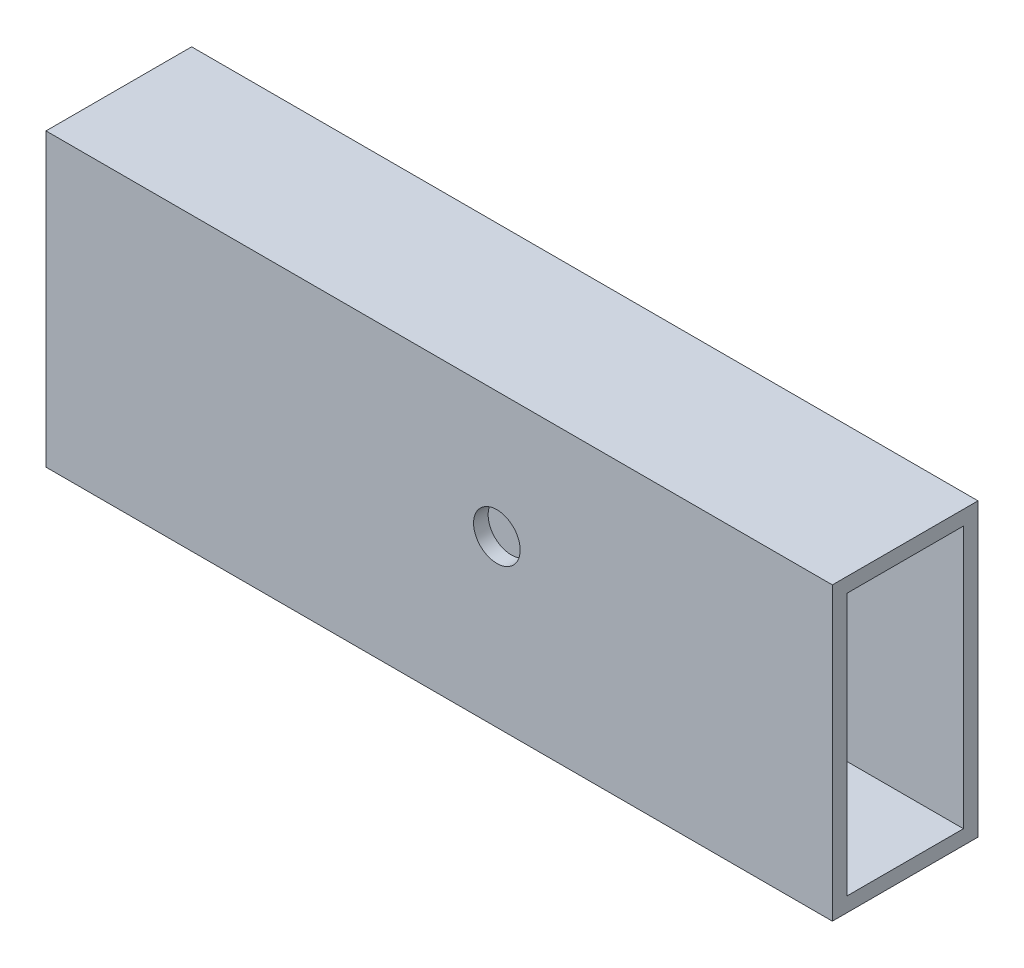
ISO-10303-21;
HEADER;
FILE_DESCRIPTION(('STEP AP214'),'2;1');
FILE_NAME('part.step','',(''),(''),'','','');
FILE_SCHEMA(('AUTOMOTIVE_DESIGN { 1 0 10303 214 1 1 1 1 }'));
ENDSEC;
DATA;
#1=APPLICATION_CONTEXT('core data for automotive mechanical design processes');
#2=APPLICATION_PROTOCOL_DEFINITION('international standard','automotive_design',2000,#1);
#3=PRODUCT_CONTEXT('',#1,'mechanical');
#4=PRODUCT('Part','Part','',(#3));
#5=PRODUCT_RELATED_PRODUCT_CATEGORY('part','',(#4));
#6=PRODUCT_DEFINITION_FORMATION('','',#4);
#7=PRODUCT_DEFINITION_CONTEXT('part definition',#1,'design');
#8=PRODUCT_DEFINITION('design','',#6,#7);
#9=PRODUCT_DEFINITION_SHAPE('','',#8);
#10=(LENGTH_UNIT() NAMED_UNIT(*) SI_UNIT(.MILLI.,.METRE.));
#11=(NAMED_UNIT(*) PLANE_ANGLE_UNIT() SI_UNIT($,.RADIAN.));
#12=(NAMED_UNIT(*) SI_UNIT($,.STERADIAN.) SOLID_ANGLE_UNIT());
#13=UNCERTAINTY_MEASURE_WITH_UNIT(LENGTH_MEASURE(1.E-05),#10,'distance_accuracy_value','');
#14=(GEOMETRIC_REPRESENTATION_CONTEXT(3) GLOBAL_UNCERTAINTY_ASSIGNED_CONTEXT((#13)) GLOBAL_UNIT_ASSIGNED_CONTEXT((#10,
#11,#12)) REPRESENTATION_CONTEXT('',''));
#15=CARTESIAN_POINT('',(0.,0.,0.));
#16=DIRECTION('',(0.,0.,1.));
#17=DIRECTION('',(1.,0.,0.));
#18=AXIS2_PLACEMENT_3D('',#15,#16,#17);
#19=CARTESIAN_POINT('',(-135.,-25.,12.5));
#20=DIRECTION('',(0.,0.,1.));
#21=DIRECTION('',(1.,0.,0.));
#22=AXIS2_PLACEMENT_3D('',#19,#20,#21);
#23=PLANE('',#22);
#24=CARTESIAN_POINT('',(-57.6002904536009,3.38908975462313,12.5));
#25=DIRECTION('',(0.,0.,1.));
#26=DIRECTION('',(1.,0.,0.));
#27=AXIS2_PLACEMENT_3D('',#24,#25,#26);
#28=CIRCLE('',#27,4.00000000000001);
#29=CARTESIAN_POINT('',(-53.6002904536009,3.38908975462313,12.5));
#30=VERTEX_POINT('',#29);
#31=EDGE_CURVE('E126',#30,#30,#28,.T.);
#32=ORIENTED_EDGE('',*,*,#31,.F.);
#33=EDGE_LOOP('',(#32));
#34=FACE_BOUND('',#33,.T.);
#35=DIRECTION('',(0.,-1.,0.));
#36=VECTOR('',#35,1.);
#37=CARTESIAN_POINT('',(0.,-25.,12.5));
#38=LINE('',#37,#36);
#39=CARTESIAN_POINT('',(0.,25.,12.5));
#40=VERTEX_POINT('',#39);
#41=CARTESIAN_POINT('',(0.,-25.,12.5));
#42=VERTEX_POINT('',#41);
#43=EDGE_CURVE('E137',#40,#42,#38,.T.);
#44=ORIENTED_EDGE('',*,*,#43,.F.);
#45=DIRECTION('',(1.,0.,0.));
#46=VECTOR('',#45,1.);
#47=CARTESIAN_POINT('',(-135.,25.,12.5));
#48=LINE('',#47,#46);
#49=CARTESIAN_POINT('',(-135.,25.,12.5));
#50=VERTEX_POINT('',#49);
#51=EDGE_CURVE('E11',#50,#40,#48,.T.);
#52=ORIENTED_EDGE('',*,*,#51,.F.);
#53=DIRECTION('',(0.,-1.,0.));
#54=VECTOR('',#53,1.);
#55=CARTESIAN_POINT('',(-135.,-25.,12.5));
#56=LINE('',#55,#54);
#57=CARTESIAN_POINT('',(-135.,-25.,12.5));
#58=VERTEX_POINT('',#57);
#59=EDGE_CURVE('E141',#50,#58,#56,.T.);
#60=ORIENTED_EDGE('',*,*,#59,.T.);
#61=DIRECTION('',(1.,0.,0.));
#62=VECTOR('',#61,1.);
#63=CARTESIAN_POINT('',(-135.,-25.,12.5));
#64=LINE('',#63,#62);
#65=EDGE_CURVE('E154',#58,#42,#64,.T.);
#66=ORIENTED_EDGE('',*,*,#65,.T.);
#67=EDGE_LOOP('',(#44,#52,#60,#66));
#68=FACE_BOUND('',#67,.T.);
#69=ADVANCED_FACE('F37',(#34,#68),#23,.T.);
#70=CARTESIAN_POINT('',(-135.,25.,-12.5));
#71=DIRECTION('',(0.,1.,0.));
#72=DIRECTION('',(0.,0.,1.));
#73=AXIS2_PLACEMENT_3D('',#70,#71,#72);
#74=PLANE('',#73);
#75=DIRECTION('',(0.,0.,1.));
#76=VECTOR('',#75,1.);
#77=CARTESIAN_POINT('',(0.,25.,-12.5));
#78=LINE('',#77,#76);
#79=CARTESIAN_POINT('',(0.,25.,-12.5));
#80=VERTEX_POINT('',#79);
#81=EDGE_CURVE('E145',#80,#40,#78,.T.);
#82=ORIENTED_EDGE('',*,*,#81,.F.);
#83=DIRECTION('',(1.,0.,0.));
#84=VECTOR('',#83,1.);
#85=CARTESIAN_POINT('',(-135.,25.,-12.5));
#86=LINE('',#85,#84);
#87=CARTESIAN_POINT('',(-135.,25.,-12.5));
#88=VERTEX_POINT('',#87);
#89=EDGE_CURVE('E45',#88,#80,#86,.T.);
#90=ORIENTED_EDGE('',*,*,#89,.F.);
#91=DIRECTION('',(0.,0.,1.));
#92=VECTOR('',#91,1.);
#93=CARTESIAN_POINT('',(-135.,25.,-12.5));
#94=LINE('',#93,#92);
#95=EDGE_CURVE('E151',#88,#50,#94,.T.);
#96=ORIENTED_EDGE('',*,*,#95,.T.);
#97=ORIENTED_EDGE('',*,*,#51,.T.);
#98=EDGE_LOOP('',(#82,#90,#96,#97));
#99=FACE_BOUND('',#98,.T.);
#100=ADVANCED_FACE('F179',(#99),#74,.T.);
#101=CARTESIAN_POINT('',(-135.,-25.,-12.5));
#102=DIRECTION('',(0.,0.,-1.));
#103=DIRECTION('',(-1.,0.,0.));
#104=AXIS2_PLACEMENT_3D('',#101,#102,#103);
#105=PLANE('',#104);
#106=DIRECTION('',(0.,1.,0.));
#107=VECTOR('',#106,1.);
#108=CARTESIAN_POINT('',(0.,-25.,-12.5));
#109=LINE('',#108,#107);
#110=CARTESIAN_POINT('',(0.,-25.,-12.5));
#111=VERTEX_POINT('',#110);
#112=EDGE_CURVE('E160',#111,#80,#109,.T.);
#113=ORIENTED_EDGE('',*,*,#112,.F.);
#114=DIRECTION('',(1.,0.,0.));
#115=VECTOR('',#114,1.);
#116=CARTESIAN_POINT('',(-135.,-25.,-12.5));
#117=LINE('',#116,#115);
#118=CARTESIAN_POINT('',(-135.,-25.,-12.5));
#119=VERTEX_POINT('',#118);
#120=EDGE_CURVE('E166',#119,#111,#117,.T.);
#121=ORIENTED_EDGE('',*,*,#120,.F.);
#122=DIRECTION('',(0.,1.,0.));
#123=VECTOR('',#122,1.);
#124=CARTESIAN_POINT('',(-135.,-25.,-12.5));
#125=LINE('',#124,#123);
#126=EDGE_CURVE('E148',#119,#88,#125,.T.);
#127=ORIENTED_EDGE('',*,*,#126,.T.);
#128=ORIENTED_EDGE('',*,*,#89,.T.);
#129=EDGE_LOOP('',(#113,#121,#127,#128));
#130=FACE_BOUND('',#129,.T.);
#131=ADVANCED_FACE('F183',(#130),#105,.T.);
#132=CARTESIAN_POINT('',(-135.,-25.,-12.5));
#133=DIRECTION('',(0.,-1.,0.));
#134=DIRECTION('',(0.,0.,-1.));
#135=AXIS2_PLACEMENT_3D('',#132,#133,#134);
#136=PLANE('',#135);
#137=DIRECTION('',(0.,0.,-1.));
#138=VECTOR('',#137,1.);
#139=CARTESIAN_POINT('',(0.,-25.,-12.5));
#140=LINE('',#139,#138);
#141=EDGE_CURVE('E157',#42,#111,#140,.T.);
#142=ORIENTED_EDGE('',*,*,#141,.F.);
#143=ORIENTED_EDGE('',*,*,#65,.F.);
#144=DIRECTION('',(0.,0.,-1.));
#145=VECTOR('',#144,1.);
#146=CARTESIAN_POINT('',(-135.,-25.,-12.5));
#147=LINE('',#146,#145);
#148=EDGE_CURVE('E144',#58,#119,#147,.T.);
#149=ORIENTED_EDGE('',*,*,#148,.T.);
#150=ORIENTED_EDGE('',*,*,#120,.T.);
#151=EDGE_LOOP('',(#142,#143,#149,#150));
#152=FACE_BOUND('',#151,.T.);
#153=ADVANCED_FACE('F173',(#152),#136,.T.);
#154=CARTESIAN_POINT('',(-135.,0.,0.));
#155=DIRECTION('',(1.,0.,0.));
#156=DIRECTION('',(0.,0.,-1.));
#157=AXIS2_PLACEMENT_3D('',#154,#155,#156);
#158=PLANE('',#157);
#159=DIRECTION('',(0.,0.,1.));
#160=VECTOR('',#159,1.);
#161=CARTESIAN_POINT('',(-135.,22.5,-10.));
#162=LINE('',#161,#160);
#163=CARTESIAN_POINT('',(-135.,22.5,-10.));
#164=VERTEX_POINT('',#163);
#165=CARTESIAN_POINT('',(-135.,22.5,10.));
#166=VERTEX_POINT('',#165);
#167=EDGE_CURVE('E110',#164,#166,#162,.T.);
#168=ORIENTED_EDGE('',*,*,#167,.T.);
#169=DIRECTION('',(0.,-1.,0.));
#170=VECTOR('',#169,1.);
#171=CARTESIAN_POINT('',(-135.,-22.5,10.));
#172=LINE('',#171,#170);
#173=CARTESIAN_POINT('',(-135.,-22.5,10.));
#174=VERTEX_POINT('',#173);
#175=EDGE_CURVE('E104',#166,#174,#172,.T.);
#176=ORIENTED_EDGE('',*,*,#175,.T.);
#177=DIRECTION('',(0.,0.,-1.));
#178=VECTOR('',#177,1.);
#179=CARTESIAN_POINT('',(-135.,-22.5,-10.));
#180=LINE('',#179,#178);
#181=CARTESIAN_POINT('',(-135.,-22.5,-10.));
#182=VERTEX_POINT('',#181);
#183=EDGE_CURVE('E113',#174,#182,#180,.T.);
#184=ORIENTED_EDGE('',*,*,#183,.T.);
#185=DIRECTION('',(0.,1.,0.));
#186=VECTOR('',#185,1.);
#187=CARTESIAN_POINT('',(-135.,-22.5,-10.));
#188=LINE('',#187,#186);
#189=EDGE_CURVE('E53',#182,#164,#188,.T.);
#190=ORIENTED_EDGE('',*,*,#189,.T.);
#191=EDGE_LOOP('',(#168,#176,#184,#190));
#192=FACE_BOUND('',#191,.T.);
#193=ORIENTED_EDGE('',*,*,#59,.F.);
#194=ORIENTED_EDGE('',*,*,#95,.F.);
#195=ORIENTED_EDGE('',*,*,#126,.F.);
#196=ORIENTED_EDGE('',*,*,#148,.F.);
#197=EDGE_LOOP('',(#193,#194,#195,#196));
#198=FACE_BOUND('',#197,.T.);
#199=ADVANCED_FACE('F117',(#192,#198),#158,.F.);
#200=CARTESIAN_POINT('',(0.,0.,0.));
#201=DIRECTION('',(1.,0.,0.));
#202=DIRECTION('',(0.,0.,-1.));
#203=AXIS2_PLACEMENT_3D('',#200,#201,#202);
#204=PLANE('',#203);
#205=DIRECTION('',(0.,-1.,0.));
#206=VECTOR('',#205,1.);
#207=CARTESIAN_POINT('',(0.,-22.5,10.));
#208=LINE('',#207,#206);
#209=CARTESIAN_POINT('',(0.,22.5,10.));
#210=VERTEX_POINT('',#209);
#211=CARTESIAN_POINT('',(0.,-22.5,10.));
#212=VERTEX_POINT('',#211);
#213=EDGE_CURVE('E61',#210,#212,#208,.T.);
#214=ORIENTED_EDGE('',*,*,#213,.F.);
#215=DIRECTION('',(0.,0.,1.));
#216=VECTOR('',#215,1.);
#217=CARTESIAN_POINT('',(0.,22.5,-10.));
#218=LINE('',#217,#216);
#219=CARTESIAN_POINT('',(0.,22.5,-10.));
#220=VERTEX_POINT('',#219);
#221=EDGE_CURVE('E120',#220,#210,#218,.T.);
#222=ORIENTED_EDGE('',*,*,#221,.F.);
#223=DIRECTION('',(0.,1.,0.));
#224=VECTOR('',#223,1.);
#225=CARTESIAN_POINT('',(0.,-22.5,-10.));
#226=LINE('',#225,#224);
#227=CARTESIAN_POINT('',(0.,-22.5,-10.));
#228=VERTEX_POINT('',#227);
#229=EDGE_CURVE('E123',#228,#220,#226,.T.);
#230=ORIENTED_EDGE('',*,*,#229,.F.);
#231=DIRECTION('',(0.,0.,-1.));
#232=VECTOR('',#231,1.);
#233=CARTESIAN_POINT('',(0.,-22.5,-10.));
#234=LINE('',#233,#232);
#235=EDGE_CURVE('E131',#212,#228,#234,.T.);
#236=ORIENTED_EDGE('',*,*,#235,.F.);
#237=EDGE_LOOP('',(#214,#222,#230,#236));
#238=FACE_BOUND('',#237,.T.);
#239=ORIENTED_EDGE('',*,*,#43,.T.);
#240=ORIENTED_EDGE('',*,*,#141,.T.);
#241=ORIENTED_EDGE('',*,*,#112,.T.);
#242=ORIENTED_EDGE('',*,*,#81,.T.);
#243=EDGE_LOOP('',(#239,#240,#241,#242));
#244=FACE_BOUND('',#243,.T.);
#245=ADVANCED_FACE('F176',(#238,#244),#204,.T.);
#246=CARTESIAN_POINT('',(-135.,-22.5,10.));
#247=DIRECTION('',(0.,0.,1.));
#248=DIRECTION('',(1.,0.,0.));
#249=AXIS2_PLACEMENT_3D('',#246,#247,#248);
#250=PLANE('',#249);
#251=CARTESIAN_POINT('',(-57.6002904536009,3.38908975462313,10.));
#252=DIRECTION('',(0.,0.,1.));
#253=DIRECTION('',(1.,0.,0.));
#254=AXIS2_PLACEMENT_3D('',#251,#252,#253);
#255=CIRCLE('',#254,4.00000000000001);
#256=CARTESIAN_POINT('',(-53.6002904536009,3.38908975462313,10.));
#257=VERTEX_POINT('',#256);
#258=EDGE_CURVE('E40',#257,#257,#255,.F.);
#259=ORIENTED_EDGE('',*,*,#258,.F.);
#260=EDGE_LOOP('',(#259));
#261=FACE_BOUND('',#260,.T.);
#262=ORIENTED_EDGE('',*,*,#213,.T.);
#263=DIRECTION('',(1.,0.,0.));
#264=VECTOR('',#263,1.);
#265=CARTESIAN_POINT('',(-135.,-22.5,10.));
#266=LINE('',#265,#264);
#267=EDGE_CURVE('E100',#174,#212,#266,.T.);
#268=ORIENTED_EDGE('',*,*,#267,.F.);
#269=ORIENTED_EDGE('',*,*,#175,.F.);
#270=DIRECTION('',(1.,0.,0.));
#271=VECTOR('',#270,1.);
#272=CARTESIAN_POINT('',(-135.,22.5,10.));
#273=LINE('',#272,#271);
#274=EDGE_CURVE('E135',#166,#210,#273,.T.);
#275=ORIENTED_EDGE('',*,*,#274,.T.);
#276=EDGE_LOOP('',(#262,#268,#269,#275));
#277=FACE_BOUND('',#276,.T.);
#278=ADVANCED_FACE('F102',(#261,#277),#250,.F.);
#279=CARTESIAN_POINT('',(-135.,22.5,-10.));
#280=DIRECTION('',(0.,1.,0.));
#281=DIRECTION('',(0.,0.,1.));
#282=AXIS2_PLACEMENT_3D('',#279,#280,#281);
#283=PLANE('',#282);
#284=ORIENTED_EDGE('',*,*,#221,.T.);
#285=ORIENTED_EDGE('',*,*,#274,.F.);
#286=ORIENTED_EDGE('',*,*,#167,.F.);
#287=DIRECTION('',(1.,0.,0.));
#288=VECTOR('',#287,1.);
#289=CARTESIAN_POINT('',(-135.,22.5,-10.));
#290=LINE('',#289,#288);
#291=EDGE_CURVE('E138',#164,#220,#290,.T.);
#292=ORIENTED_EDGE('',*,*,#291,.T.);
#293=EDGE_LOOP('',(#284,#285,#286,#292));
#294=FACE_BOUND('',#293,.T.);
#295=ADVANCED_FACE('F204',(#294),#283,.F.);
#296=CARTESIAN_POINT('',(-135.,-22.5,-10.));
#297=DIRECTION('',(0.,0.,-1.));
#298=DIRECTION('',(-1.,0.,0.));
#299=AXIS2_PLACEMENT_3D('',#296,#297,#298);
#300=PLANE('',#299);
#301=ORIENTED_EDGE('',*,*,#229,.T.);
#302=ORIENTED_EDGE('',*,*,#291,.F.);
#303=ORIENTED_EDGE('',*,*,#189,.F.);
#304=DIRECTION('',(1.,0.,0.));
#305=VECTOR('',#304,1.);
#306=CARTESIAN_POINT('',(-135.,-22.5,-10.));
#307=LINE('',#306,#305);
#308=EDGE_CURVE('E109',#182,#228,#307,.T.);
#309=ORIENTED_EDGE('',*,*,#308,.T.);
#310=EDGE_LOOP('',(#301,#302,#303,#309));
#311=FACE_BOUND('',#310,.T.);
#312=ADVANCED_FACE('F210',(#311),#300,.F.);
#313=CARTESIAN_POINT('',(-135.,-22.5,-10.));
#314=DIRECTION('',(0.,-1.,0.));
#315=DIRECTION('',(0.,0.,-1.));
#316=AXIS2_PLACEMENT_3D('',#313,#314,#315);
#317=PLANE('',#316);
#318=ORIENTED_EDGE('',*,*,#235,.T.);
#319=ORIENTED_EDGE('',*,*,#308,.F.);
#320=ORIENTED_EDGE('',*,*,#183,.F.);
#321=ORIENTED_EDGE('',*,*,#267,.T.);
#322=EDGE_LOOP('',(#318,#319,#320,#321));
#323=FACE_BOUND('',#322,.T.);
#324=ADVANCED_FACE('F114',(#323),#317,.F.);
#325=CARTESIAN_POINT('',(-57.6002904536009,3.38908975462313,12.5));
#326=DIRECTION('',(0.,0.,-1.));
#327=DIRECTION('',(-1.,0.,0.));
#328=AXIS2_PLACEMENT_3D('',#325,#326,#327);
#329=CYLINDRICAL_SURFACE('',#328,4.00000000000001);
#330=ORIENTED_EDGE('',*,*,#31,.T.);
#331=EDGE_LOOP('',(#330));
#332=FACE_BOUND('',#331,.T.);
#333=ORIENTED_EDGE('',*,*,#258,.T.);
#334=EDGE_LOOP('',(#333));
#335=FACE_BOUND('',#334,.T.);
#336=ADVANCED_FACE('F201',(#332,#335),#329,.F.);
#337=CLOSED_SHELL('',(#69,#100,#131,#153,#199,#245,#278,#295,#312,#324,#336));
#338=MANIFOLD_SOLID_BREP('B2',#337);
#339=ADVANCED_BREP_SHAPE_REPRESENTATION('',(#18,#338),#14);
#340=SHAPE_DEFINITION_REPRESENTATION(#9,#339);
ENDSEC;
END-ISO-10303-21;
